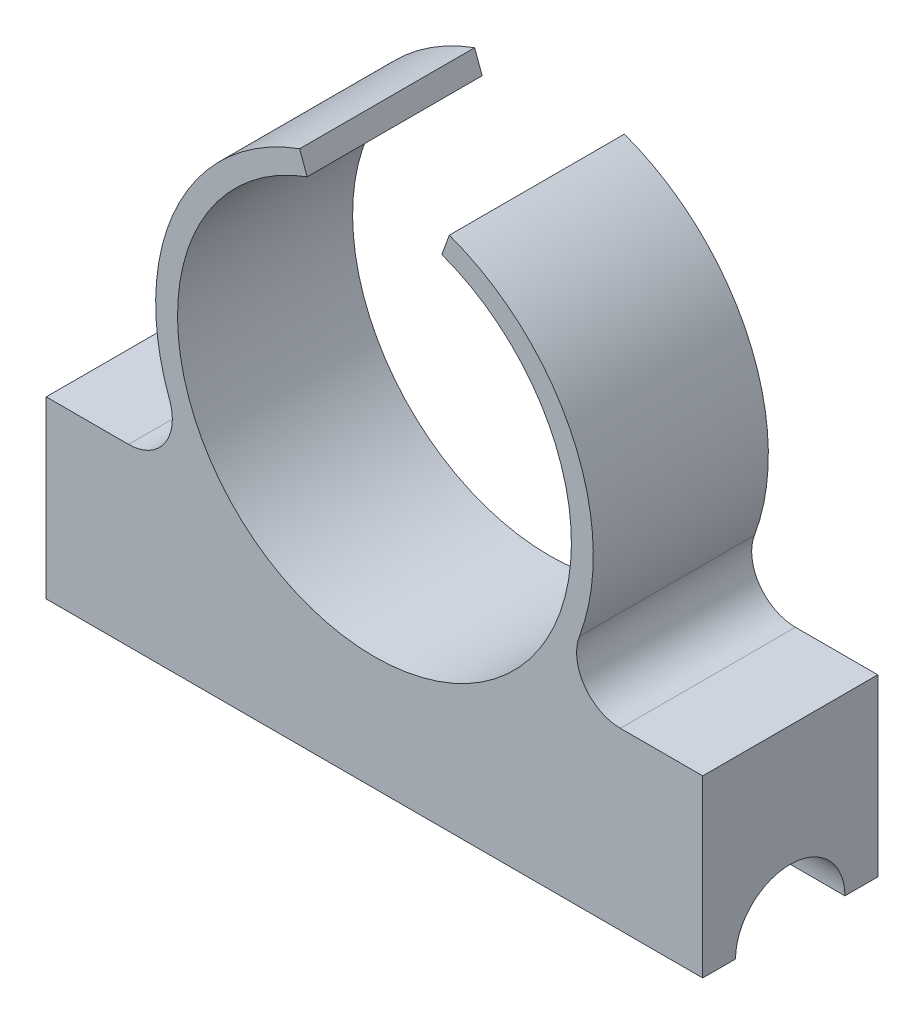
ISO-10303-21;
HEADER;
FILE_DESCRIPTION(('STEP AP214'),'2;1');
FILE_NAME('part.step','',(''),(''),'','','');
FILE_SCHEMA(('AUTOMOTIVE_DESIGN { 1 0 10303 214 1 1 1 1 }'));
ENDSEC;
DATA;
#1=APPLICATION_CONTEXT('core data for automotive mechanical design processes');
#2=APPLICATION_PROTOCOL_DEFINITION('international standard','automotive_design',2000,#1);
#3=PRODUCT_CONTEXT('',#1,'mechanical');
#4=PRODUCT('Part','Part','',(#3));
#5=PRODUCT_RELATED_PRODUCT_CATEGORY('part','',(#4));
#6=PRODUCT_DEFINITION_FORMATION('','',#4);
#7=PRODUCT_DEFINITION_CONTEXT('part definition',#1,'design');
#8=PRODUCT_DEFINITION('design','',#6,#7);
#9=PRODUCT_DEFINITION_SHAPE('','',#8);
#10=(LENGTH_UNIT() NAMED_UNIT(*) SI_UNIT(.MILLI.,.METRE.));
#11=(NAMED_UNIT(*) PLANE_ANGLE_UNIT() SI_UNIT($,.RADIAN.));
#12=(NAMED_UNIT(*) SI_UNIT($,.STERADIAN.) SOLID_ANGLE_UNIT());
#13=UNCERTAINTY_MEASURE_WITH_UNIT(LENGTH_MEASURE(1.E-05),#10,'distance_accuracy_value','');
#14=(GEOMETRIC_REPRESENTATION_CONTEXT(3) GLOBAL_UNCERTAINTY_ASSIGNED_CONTEXT((#13)) GLOBAL_UNIT_ASSIGNED_CONTEXT((#10,
#11,#12)) REPRESENTATION_CONTEXT('',''));
#15=CARTESIAN_POINT('',(0.,0.,0.));
#16=DIRECTION('',(0.,0.,1.));
#17=DIRECTION('',(1.,0.,0.));
#18=AXIS2_PLACEMENT_3D('',#15,#16,#17);
#19=CARTESIAN_POINT('',(-15.,-2.5,8.));
#20=DIRECTION('',(0.,1.,0.));
#21=DIRECTION('',(0.,0.,1.));
#22=AXIS2_PLACEMENT_3D('',#19,#20,#21);
#23=PLANE('',#22);
#24=DIRECTION('',(0.,0.,-1.));
#25=VECTOR('',#24,1.);
#26=CARTESIAN_POINT('',(-15.,-2.5,8.));
#27=LINE('',#26,#25);
#28=CARTESIAN_POINT('',(-15.,-2.5,8.));
#29=VERTEX_POINT('',#28);
#30=CARTESIAN_POINT('',(-15.,-2.5,6.5));
#31=VERTEX_POINT('',#30);
#32=EDGE_CURVE('E189',#29,#31,#27,.T.);
#33=ORIENTED_EDGE('',*,*,#32,.T.);
#34=DIRECTION('',(1.,0.,0.));
#35=VECTOR('',#34,1.);
#36=CARTESIAN_POINT('',(-95.,-2.5,6.5));
#37=LINE('',#36,#35);
#38=CARTESIAN_POINT('',(15.,-2.5,6.5));
#39=VERTEX_POINT('',#38);
#40=EDGE_CURVE('E200',#31,#39,#37,.T.);
#41=ORIENTED_EDGE('',*,*,#40,.T.);
#42=DIRECTION('',(0.,0.,-1.));
#43=VECTOR('',#42,1.);
#44=CARTESIAN_POINT('',(15.,-2.5,8.));
#45=LINE('',#44,#43);
#46=CARTESIAN_POINT('',(15.,-2.5,8.));
#47=VERTEX_POINT('',#46);
#48=EDGE_CURVE('E183',#47,#39,#45,.T.);
#49=ORIENTED_EDGE('',*,*,#48,.F.);
#50=DIRECTION('',(1.,0.,0.));
#51=VECTOR('',#50,1.);
#52=CARTESIAN_POINT('',(-15.,-2.5,8.));
#53=LINE('',#52,#51);
#54=EDGE_CURVE('E253',#29,#47,#53,.T.);
#55=ORIENTED_EDGE('',*,*,#54,.F.);
#56=EDGE_LOOP('',(#33,#41,#49,#55));
#57=FACE_BOUND('',#56,.T.);
#58=ADVANCED_FACE('F39',(#57),#23,.F.);
#59=CARTESIAN_POINT('',(0.,11.7123465704765,8.));
#60=DIRECTION('',(0.,0.,-1.));
#61=DIRECTION('',(-1.,0.,0.));
#62=AXIS2_PLACEMENT_3D('',#59,#60,#61);
#63=CYLINDRICAL_SURFACE('',#62,10.);
#64=CARTESIAN_POINT('',(0.,11.7123465704765,8.));
#65=DIRECTION('',(0.,0.,1.));
#66=DIRECTION('',(1.,0.,0.));
#67=AXIS2_PLACEMENT_3D('',#64,#65,#66);
#68=CIRCLE('',#67,10.);
#69=CARTESIAN_POINT('',(-3.42020143325666,21.1092727783356,8.));
#70=VERTEX_POINT('',#69);
#71=CARTESIAN_POINT('',(-9.36364632391154,8.20205776174608,8.));
#72=VERTEX_POINT('',#71);
#73=EDGE_CURVE('E154',#70,#72,#68,.T.);
#74=ORIENTED_EDGE('',*,*,#73,.F.);
#75=DIRECTION('',(0.,0.,-1.));
#76=VECTOR('',#75,1.);
#77=CARTESIAN_POINT('',(-3.42020143325666,21.1092727783356,30.));
#78=LINE('',#77,#76);
#79=CARTESIAN_POINT('',(-3.42020143325666,21.1092727783356,0.));
#80=VERTEX_POINT('',#79);
#81=EDGE_CURVE('E141',#70,#80,#78,.T.);
#82=ORIENTED_EDGE('',*,*,#81,.T.);
#83=CARTESIAN_POINT('',(0.,11.7123465704765,0.));
#84=DIRECTION('',(0.,0.,1.));
#85=DIRECTION('',(1.,0.,0.));
#86=AXIS2_PLACEMENT_3D('',#83,#84,#85);
#87=CIRCLE('',#86,10.);
#88=CARTESIAN_POINT('',(-9.36364632391154,8.20205776174608,0.));
#89=VERTEX_POINT('',#88);
#90=EDGE_CURVE('E152',#80,#89,#87,.T.);
#91=ORIENTED_EDGE('',*,*,#90,.T.);
#92=DIRECTION('',(0.,0.,-1.));
#93=VECTOR('',#92,1.);
#94=CARTESIAN_POINT('',(-9.36364632391154,8.20205776174608,8.));
#95=LINE('',#94,#93);
#96=EDGE_CURVE('E204',#89,#72,#95,.F.);
#97=ORIENTED_EDGE('',*,*,#96,.T.);
#98=EDGE_LOOP('',(#74,#82,#91,#97));
#99=FACE_BOUND('',#98,.T.);
#100=ADVANCED_FACE('F150',(#99),#63,.T.);
#101=CARTESIAN_POINT('',(15.,-2.5,8.));
#102=DIRECTION('',(-1.,0.,0.));
#103=DIRECTION('',(0.,0.,1.));
#104=AXIS2_PLACEMENT_3D('',#101,#102,#103);
#105=PLANE('',#104);
#106=ORIENTED_EDGE('',*,*,#48,.T.);
#107=CARTESIAN_POINT('',(15.,-2.5,4.));
#108=DIRECTION('',(1.,0.,0.));
#109=DIRECTION('',(0.,0.,-1.));
#110=AXIS2_PLACEMENT_3D('',#107,#108,#109);
#111=CIRCLE('',#110,2.5);
#112=CARTESIAN_POINT('',(15.,-2.5,1.5));
#113=VERTEX_POINT('',#112);
#114=EDGE_CURVE('E242',#113,#39,#111,.T.);
#115=ORIENTED_EDGE('',*,*,#114,.F.);
#116=CARTESIAN_POINT('',(15.,-2.5,0.));
#117=VERTEX_POINT('',#116);
#118=EDGE_CURVE('E188',#113,#117,#45,.T.);
#119=ORIENTED_EDGE('',*,*,#118,.T.);
#120=DIRECTION('',(0.,1.,0.));
#121=VECTOR('',#120,1.);
#122=CARTESIAN_POINT('',(15.,-2.5,0.));
#123=LINE('',#122,#121);
#124=CARTESIAN_POINT('',(15.,5.5,0.));
#125=VERTEX_POINT('',#124);
#126=EDGE_CURVE('E165',#117,#125,#123,.T.);
#127=ORIENTED_EDGE('',*,*,#126,.T.);
#128=DIRECTION('',(0.,0.,-1.));
#129=VECTOR('',#128,1.);
#130=CARTESIAN_POINT('',(15.,5.5,0.));
#131=LINE('',#130,#129);
#132=CARTESIAN_POINT('',(15.,5.5,8.));
#133=VERTEX_POINT('',#132);
#134=EDGE_CURVE('E280',#133,#125,#131,.T.);
#135=ORIENTED_EDGE('',*,*,#134,.F.);
#136=DIRECTION('',(0.,1.,0.));
#137=VECTOR('',#136,1.);
#138=CARTESIAN_POINT('',(15.,-2.5,8.));
#139=LINE('',#138,#137);
#140=EDGE_CURVE('E182',#47,#133,#139,.T.);
#141=ORIENTED_EDGE('',*,*,#140,.F.);
#142=EDGE_LOOP('',(#106,#115,#119,#127,#135,#141));
#143=FACE_BOUND('',#142,.T.);
#144=ADVANCED_FACE('F261',(#143),#105,.F.);
#145=CARTESIAN_POINT('',(9.36364632391154,8.20205776174608,0.));
#146=VERTEX_POINT('',#145);
#147=CARTESIAN_POINT('',(3.42020143325666,21.1092727783356,0.));
#148=VERTEX_POINT('',#147);
#149=EDGE_CURVE('E164',#146,#148,#87,.T.);
#150=ORIENTED_EDGE('',*,*,#149,.T.);
#151=DIRECTION('',(0.,0.,-1.));
#152=VECTOR('',#151,1.);
#153=CARTESIAN_POINT('',(3.42020143325666,21.1092727783356,30.));
#154=LINE('',#153,#152);
#155=CARTESIAN_POINT('',(3.42020143325666,21.1092727783356,8.));
#156=VERTEX_POINT('',#155);
#157=EDGE_CURVE('E156',#156,#148,#154,.T.);
#158=ORIENTED_EDGE('',*,*,#157,.F.);
#159=CARTESIAN_POINT('',(9.36364632391154,8.20205776174608,8.));
#160=VERTEX_POINT('',#159);
#161=EDGE_CURVE('E248',#160,#156,#68,.T.);
#162=ORIENTED_EDGE('',*,*,#161,.F.);
#163=DIRECTION('',(0.,0.,-1.));
#164=VECTOR('',#163,1.);
#165=CARTESIAN_POINT('',(9.36364632391154,8.20205776174608,8.));
#166=LINE('',#165,#164);
#167=EDGE_CURVE('E210',#160,#146,#166,.T.);
#168=ORIENTED_EDGE('',*,*,#167,.T.);
#169=EDGE_LOOP('',(#150,#158,#162,#168));
#170=FACE_BOUND('',#169,.T.);
#171=ADVANCED_FACE('F307',(#170),#63,.T.);
#172=CARTESIAN_POINT('',(-15.,-2.5,8.));
#173=DIRECTION('',(1.,0.,0.));
#174=DIRECTION('',(0.,0.,-1.));
#175=AXIS2_PLACEMENT_3D('',#172,#173,#174);
#176=PLANE('',#175);
#177=CARTESIAN_POINT('',(-15.,-2.5,1.5));
#178=VERTEX_POINT('',#177);
#179=CARTESIAN_POINT('',(-15.,-2.5,0.));
#180=VERTEX_POINT('',#179);
#181=EDGE_CURVE('E187',#178,#180,#27,.T.);
#182=ORIENTED_EDGE('',*,*,#181,.F.);
#183=CARTESIAN_POINT('',(-15.,-2.5,4.));
#184=DIRECTION('',(1.,0.,0.));
#185=DIRECTION('',(0.,0.,-1.));
#186=AXIS2_PLACEMENT_3D('',#183,#184,#185);
#187=CIRCLE('',#186,2.5);
#188=EDGE_CURVE('E238',#178,#31,#187,.T.);
#189=ORIENTED_EDGE('',*,*,#188,.T.);
#190=ORIENTED_EDGE('',*,*,#32,.F.);
#191=DIRECTION('',(0.,-1.,0.));
#192=VECTOR('',#191,1.);
#193=CARTESIAN_POINT('',(-15.,-2.5,8.));
#194=LINE('',#193,#192);
#195=CARTESIAN_POINT('',(-15.,5.5,8.));
#196=VERTEX_POINT('',#195);
#197=EDGE_CURVE('E251',#196,#29,#194,.T.);
#198=ORIENTED_EDGE('',*,*,#197,.F.);
#199=DIRECTION('',(0.,0.,-1.));
#200=VECTOR('',#199,1.);
#201=CARTESIAN_POINT('',(-15.,5.5,0.));
#202=LINE('',#201,#200);
#203=CARTESIAN_POINT('',(-15.,5.5,0.));
#204=VERTEX_POINT('',#203);
#205=EDGE_CURVE('E287',#196,#204,#202,.T.);
#206=ORIENTED_EDGE('',*,*,#205,.T.);
#207=DIRECTION('',(0.,-1.,0.));
#208=VECTOR('',#207,1.);
#209=CARTESIAN_POINT('',(-15.,-2.5,0.));
#210=LINE('',#209,#208);
#211=EDGE_CURVE('E170',#204,#180,#210,.T.);
#212=ORIENTED_EDGE('',*,*,#211,.T.);
#213=EDGE_LOOP('',(#182,#189,#190,#198,#206,#212));
#214=FACE_BOUND('',#213,.T.);
#215=ADVANCED_FACE('F332',(#214),#176,.F.);
#216=ORIENTED_EDGE('',*,*,#118,.F.);
#217=DIRECTION('',(1.,0.,0.));
#218=VECTOR('',#217,1.);
#219=CARTESIAN_POINT('',(-95.,-2.5,1.5));
#220=LINE('',#219,#218);
#221=EDGE_CURVE('E193',#113,#178,#220,.F.);
#222=ORIENTED_EDGE('',*,*,#221,.T.);
#223=ORIENTED_EDGE('',*,*,#181,.T.);
#224=DIRECTION('',(1.,0.,0.));
#225=VECTOR('',#224,1.);
#226=CARTESIAN_POINT('',(-15.,-2.5,0.));
#227=LINE('',#226,#225);
#228=EDGE_CURVE('E178',#180,#117,#227,.T.);
#229=ORIENTED_EDGE('',*,*,#228,.T.);
#230=EDGE_LOOP('',(#216,#222,#223,#229));
#231=FACE_BOUND('',#230,.T.);
#232=ADVANCED_FACE('F267',(#231),#23,.F.);
#233=CARTESIAN_POINT('',(0.,11.7123465704765,8.));
#234=DIRECTION('',(0.,0.,1.));
#235=DIRECTION('',(1.,0.,0.));
#236=AXIS2_PLACEMENT_3D('',#233,#234,#235);
#237=PLANE('',#236);
#238=DIRECTION('',(0.342020143325666,0.93969262078591,0.));
#239=VECTOR('',#238,1.);
#240=CARTESIAN_POINT('',(0.,11.7123465704765,8.));
#241=LINE('',#240,#239);
#242=CARTESIAN_POINT('',(3.07818128993099,20.1695801575497,8.));
#243=VERTEX_POINT('',#242);
#244=EDGE_CURVE('E236',#243,#156,#241,.T.);
#245=ORIENTED_EDGE('',*,*,#244,.F.);
#246=CARTESIAN_POINT('',(0.,11.7123465704765,8.));
#247=DIRECTION('',(0.,0.,1.));
#248=DIRECTION('',(1.,0.,0.));
#249=AXIS2_PLACEMENT_3D('',#246,#247,#248);
#250=CIRCLE('',#249,9.);
#251=CARTESIAN_POINT('',(-3.07818128993099,20.1695801575497,8.));
#252=VERTEX_POINT('',#251);
#253=EDGE_CURVE('E196',#252,#243,#250,.T.);
#254=ORIENTED_EDGE('',*,*,#253,.F.);
#255=DIRECTION('',(0.342020143325666,-0.93969262078591,0.));
#256=VECTOR('',#255,1.);
#257=CARTESIAN_POINT('',(0.,11.7123465704765,8.));
#258=LINE('',#257,#256);
#259=EDGE_CURVE('E55',#70,#252,#258,.T.);
#260=ORIENTED_EDGE('',*,*,#259,.F.);
#261=ORIENTED_EDGE('',*,*,#73,.T.);
#262=CARTESIAN_POINT('',(-11.2363755886938,7.5,8.));
#263=DIRECTION('',(0.,0.,1.));
#264=DIRECTION('',(1.,0.,0.));
#265=AXIS2_PLACEMENT_3D('',#262,#263,#264);
#266=CIRCLE('',#265,2.);
#267=CARTESIAN_POINT('',(-11.2363755886938,5.5,8.));
#268=VERTEX_POINT('',#267);
#269=EDGE_CURVE('E217',#72,#268,#266,.F.);
#270=ORIENTED_EDGE('',*,*,#269,.T.);
#271=DIRECTION('',(-1.,0.,0.));
#272=VECTOR('',#271,1.);
#273=CARTESIAN_POINT('',(15.,5.5,8.));
#274=LINE('',#273,#272);
#275=EDGE_CURVE('E286',#268,#196,#274,.T.);
#276=ORIENTED_EDGE('',*,*,#275,.T.);
#277=ORIENTED_EDGE('',*,*,#197,.T.);
#278=ORIENTED_EDGE('',*,*,#54,.T.);
#279=ORIENTED_EDGE('',*,*,#140,.T.);
#280=CARTESIAN_POINT('',(11.2363755886938,5.5,8.));
#281=VERTEX_POINT('',#280);
#282=EDGE_CURVE('E283',#133,#281,#274,.T.);
#283=ORIENTED_EDGE('',*,*,#282,.T.);
#284=CARTESIAN_POINT('',(11.2363755886938,7.5,8.));
#285=DIRECTION('',(0.,0.,1.));
#286=DIRECTION('',(1.,0.,0.));
#287=AXIS2_PLACEMENT_3D('',#284,#285,#286);
#288=CIRCLE('',#287,2.);
#289=EDGE_CURVE('E225',#281,#160,#288,.F.);
#290=ORIENTED_EDGE('',*,*,#289,.T.);
#291=ORIENTED_EDGE('',*,*,#161,.T.);
#292=EDGE_LOOP('',(#245,#254,#260,#261,#270,#276,#277,#278,#279,#283,#290,#291));
#293=FACE_BOUND('',#292,.T.);
#294=ADVANCED_FACE('F234',(#293),#237,.T.);
#295=CARTESIAN_POINT('',(0.,11.7123465704765,0.));
#296=DIRECTION('',(0.,0.,1.));
#297=DIRECTION('',(1.,0.,0.));
#298=AXIS2_PLACEMENT_3D('',#295,#296,#297);
#299=PLANE('',#298);
#300=CARTESIAN_POINT('',(0.,11.7123465704765,0.));
#301=DIRECTION('',(0.,0.,1.));
#302=DIRECTION('',(1.,0.,0.));
#303=AXIS2_PLACEMENT_3D('',#300,#301,#302);
#304=CIRCLE('',#303,9.);
#305=CARTESIAN_POINT('',(-3.07818128993099,20.1695801575497,0.));
#306=VERTEX_POINT('',#305);
#307=CARTESIAN_POINT('',(3.07818128993099,20.1695801575497,0.));
#308=VERTEX_POINT('',#307);
#309=EDGE_CURVE('E171',#306,#308,#304,.T.);
#310=ORIENTED_EDGE('',*,*,#309,.T.);
#311=DIRECTION('',(-0.342020143325666,-0.93969262078591,0.));
#312=VECTOR('',#311,1.);
#313=CARTESIAN_POINT('',(0.,11.7123465704765,0.));
#314=LINE('',#313,#312);
#315=EDGE_CURVE('E63',#148,#308,#314,.T.);
#316=ORIENTED_EDGE('',*,*,#315,.F.);
#317=ORIENTED_EDGE('',*,*,#149,.F.);
#318=CARTESIAN_POINT('',(11.2363755886938,7.5,0.));
#319=DIRECTION('',(0.,0.,1.));
#320=DIRECTION('',(1.,0.,0.));
#321=AXIS2_PLACEMENT_3D('',#318,#319,#320);
#322=CIRCLE('',#321,2.);
#323=CARTESIAN_POINT('',(11.2363755886938,5.5,0.));
#324=VERTEX_POINT('',#323);
#325=EDGE_CURVE('E222',#146,#324,#322,.T.);
#326=ORIENTED_EDGE('',*,*,#325,.T.);
#327=DIRECTION('',(-1.,0.,0.));
#328=VECTOR('',#327,1.);
#329=CARTESIAN_POINT('',(15.,5.5,0.));
#330=LINE('',#329,#328);
#331=EDGE_CURVE('E271',#125,#324,#330,.T.);
#332=ORIENTED_EDGE('',*,*,#331,.F.);
#333=ORIENTED_EDGE('',*,*,#126,.F.);
#334=ORIENTED_EDGE('',*,*,#228,.F.);
#335=ORIENTED_EDGE('',*,*,#211,.F.);
#336=CARTESIAN_POINT('',(-11.2363755886938,5.5,0.));
#337=VERTEX_POINT('',#336);
#338=EDGE_CURVE('E277',#337,#204,#330,.T.);
#339=ORIENTED_EDGE('',*,*,#338,.F.);
#340=CARTESIAN_POINT('',(-11.2363755886938,7.5,0.));
#341=DIRECTION('',(0.,0.,1.));
#342=DIRECTION('',(1.,0.,0.));
#343=AXIS2_PLACEMENT_3D('',#340,#341,#342);
#344=CIRCLE('',#343,2.);
#345=EDGE_CURVE('E161',#337,#89,#344,.T.);
#346=ORIENTED_EDGE('',*,*,#345,.T.);
#347=ORIENTED_EDGE('',*,*,#90,.F.);
#348=DIRECTION('',(-0.342020143325666,0.93969262078591,0.));
#349=VECTOR('',#348,1.);
#350=CARTESIAN_POINT('',(0.,11.7123465704765,0.));
#351=LINE('',#350,#349);
#352=EDGE_CURVE('E138',#306,#80,#351,.T.);
#353=ORIENTED_EDGE('',*,*,#352,.F.);
#354=EDGE_LOOP('',(#310,#316,#317,#326,#332,#333,#334,#335,#339,#346,#347,#353));
#355=FACE_BOUND('',#354,.T.);
#356=ADVANCED_FACE('F158',(#355),#299,.F.);
#357=CARTESIAN_POINT('',(0.,11.7123465704765,-27.));
#358=DIRECTION('',(0.,0.,1.));
#359=DIRECTION('',(1.,0.,0.));
#360=AXIS2_PLACEMENT_3D('',#357,#358,#359);
#361=CYLINDRICAL_SURFACE('',#360,9.);
#362=ORIENTED_EDGE('',*,*,#253,.T.);
#363=DIRECTION('',(0.,0.,1.));
#364=VECTOR('',#363,1.);
#365=CARTESIAN_POINT('',(3.07818128993099,20.1695801575497,-27.));
#366=LINE('',#365,#364);
#367=EDGE_CURVE('E11',#243,#308,#366,.F.);
#368=ORIENTED_EDGE('',*,*,#367,.T.);
#369=ORIENTED_EDGE('',*,*,#309,.F.);
#370=DIRECTION('',(0.,0.,1.));
#371=VECTOR('',#370,1.);
#372=CARTESIAN_POINT('',(-3.07818128993099,20.1695801575497,-27.));
#373=LINE('',#372,#371);
#374=EDGE_CURVE('E48',#306,#252,#373,.T.);
#375=ORIENTED_EDGE('',*,*,#374,.T.);
#376=EDGE_LOOP('',(#362,#368,#369,#375));
#377=FACE_BOUND('',#376,.T.);
#378=ADVANCED_FACE('F231',(#377),#361,.F.);
#379=CARTESIAN_POINT('',(-95.,-2.5,4.));
#380=DIRECTION('',(1.,0.,0.));
#381=DIRECTION('',(0.,0.,-1.));
#382=AXIS2_PLACEMENT_3D('',#379,#380,#381);
#383=CYLINDRICAL_SURFACE('',#382,2.5);
#384=ORIENTED_EDGE('',*,*,#188,.F.);
#385=ORIENTED_EDGE('',*,*,#221,.F.);
#386=ORIENTED_EDGE('',*,*,#114,.T.);
#387=ORIENTED_EDGE('',*,*,#40,.F.);
#388=EDGE_LOOP('',(#384,#385,#386,#387));
#389=FACE_BOUND('',#388,.T.);
#390=ADVANCED_FACE('F299',(#389),#383,.F.);
#391=CARTESIAN_POINT('',(15.,5.5,0.));
#392=DIRECTION('',(0.,1.,0.));
#393=DIRECTION('',(0.,0.,1.));
#394=AXIS2_PLACEMENT_3D('',#391,#392,#393);
#395=PLANE('',#394);
#396=ORIENTED_EDGE('',*,*,#275,.F.);
#397=DIRECTION('',(0.,0.,-1.));
#398=VECTOR('',#397,1.);
#399=CARTESIAN_POINT('',(-11.2363755886938,5.5,0.));
#400=LINE('',#399,#398);
#401=EDGE_CURVE('E207',#268,#337,#400,.T.);
#402=ORIENTED_EDGE('',*,*,#401,.T.);
#403=ORIENTED_EDGE('',*,*,#338,.T.);
#404=ORIENTED_EDGE('',*,*,#205,.F.);
#405=EDGE_LOOP('',(#396,#402,#403,#404));
#406=FACE_BOUND('',#405,.T.);
#407=ADVANCED_FACE('F351',(#406),#395,.T.);
#408=ORIENTED_EDGE('',*,*,#331,.T.);
#409=DIRECTION('',(0.,0.,-1.));
#410=VECTOR('',#409,1.);
#411=CARTESIAN_POINT('',(11.2363755886938,5.5,0.));
#412=LINE('',#411,#410);
#413=EDGE_CURVE('E214',#324,#281,#412,.F.);
#414=ORIENTED_EDGE('',*,*,#413,.T.);
#415=ORIENTED_EDGE('',*,*,#282,.F.);
#416=ORIENTED_EDGE('',*,*,#134,.T.);
#417=EDGE_LOOP('',(#408,#414,#415,#416));
#418=FACE_BOUND('',#417,.T.);
#419=ADVANCED_FACE('F281',(#418),#395,.T.);
#420=CARTESIAN_POINT('',(-11.2363755886938,7.5,8.));
#421=DIRECTION('',(0.,0.,-1.));
#422=DIRECTION('',(-1.,0.,0.));
#423=AXIS2_PLACEMENT_3D('',#420,#421,#422);
#424=CYLINDRICAL_SURFACE('',#423,2.);
#425=ORIENTED_EDGE('',*,*,#345,.F.);
#426=ORIENTED_EDGE('',*,*,#401,.F.);
#427=ORIENTED_EDGE('',*,*,#269,.F.);
#428=ORIENTED_EDGE('',*,*,#96,.F.);
#429=EDGE_LOOP('',(#425,#426,#427,#428));
#430=FACE_BOUND('',#429,.T.);
#431=ADVANCED_FACE('F344',(#430),#424,.F.);
#432=CARTESIAN_POINT('',(11.2363755886938,7.5,8.));
#433=DIRECTION('',(0.,0.,-1.));
#434=DIRECTION('',(-1.,0.,0.));
#435=AXIS2_PLACEMENT_3D('',#432,#433,#434);
#436=CYLINDRICAL_SURFACE('',#435,2.);
#437=ORIENTED_EDGE('',*,*,#289,.F.);
#438=ORIENTED_EDGE('',*,*,#413,.F.);
#439=ORIENTED_EDGE('',*,*,#325,.F.);
#440=ORIENTED_EDGE('',*,*,#167,.F.);
#441=EDGE_LOOP('',(#437,#438,#439,#440));
#442=FACE_BOUND('',#441,.T.);
#443=ADVANCED_FACE('F41',(#442),#436,.F.);
#444=CARTESIAN_POINT('',(0.,11.7123465704765,30.));
#445=DIRECTION('',(-0.93969262078591,-0.342020143325666,0.));
#446=DIRECTION('',(0.342020143325666,-0.93969262078591,0.));
#447=AXIS2_PLACEMENT_3D('',#444,#445,#446);
#448=PLANE('',#447);
#449=ORIENTED_EDGE('',*,*,#259,.T.);
#450=ORIENTED_EDGE('',*,*,#374,.F.);
#451=ORIENTED_EDGE('',*,*,#352,.T.);
#452=ORIENTED_EDGE('',*,*,#81,.F.);
#453=EDGE_LOOP('',(#449,#450,#451,#452));
#454=FACE_BOUND('',#453,.T.);
#455=ADVANCED_FACE('F140',(#454),#448,.F.);
#456=CARTESIAN_POINT('',(0.,11.7123465704765,30.));
#457=DIRECTION('',(0.93969262078591,-0.342020143325666,0.));
#458=DIRECTION('',(0.342020143325666,0.93969262078591,0.));
#459=AXIS2_PLACEMENT_3D('',#456,#457,#458);
#460=PLANE('',#459);
#461=ORIENTED_EDGE('',*,*,#244,.T.);
#462=ORIENTED_EDGE('',*,*,#157,.T.);
#463=ORIENTED_EDGE('',*,*,#315,.T.);
#464=ORIENTED_EDGE('',*,*,#367,.F.);
#465=EDGE_LOOP('',(#461,#462,#463,#464));
#466=FACE_BOUND('',#465,.T.);
#467=ADVANCED_FACE('F315',(#466),#460,.F.);
#468=CLOSED_SHELL('',(#58,#100,#144,#171,#215,#232,#294,#356,#378,#390,#407,#419,#431,#443,#455,#467));
#469=MANIFOLD_SOLID_BREP('B2',#468);
#470=ADVANCED_BREP_SHAPE_REPRESENTATION('',(#18,#469),#14);
#471=SHAPE_DEFINITION_REPRESENTATION(#9,#470);
ENDSEC;
END-ISO-10303-21;
